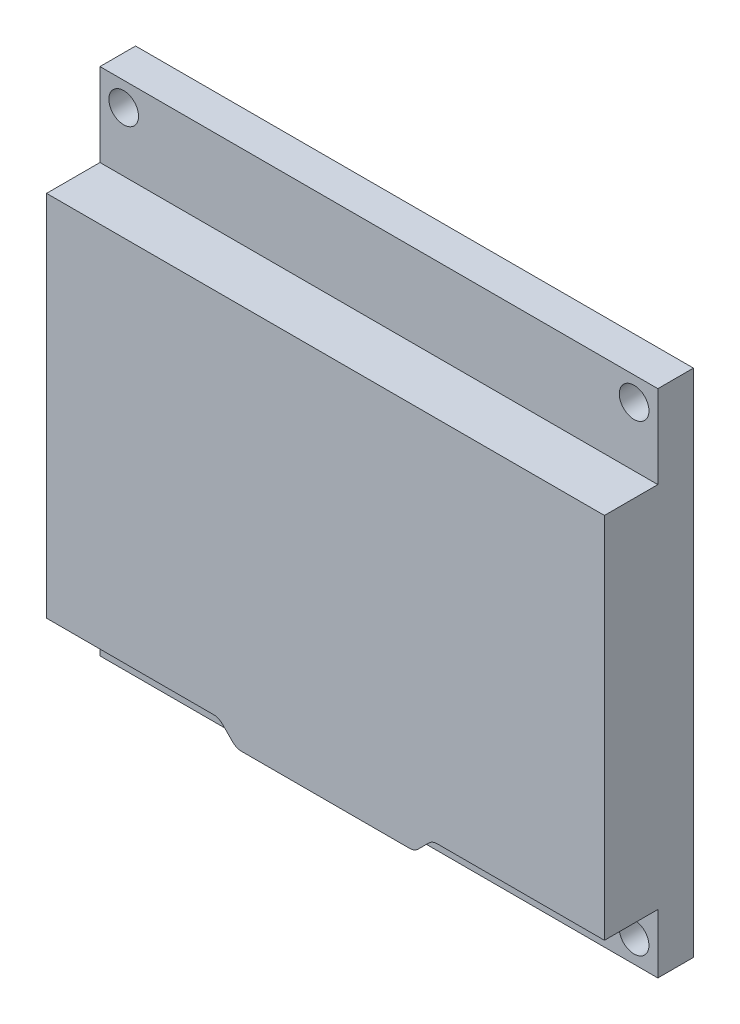
ISO-10303-21;
HEADER;
FILE_DESCRIPTION(('STEP AP214'),'2;1');
FILE_NAME('part.step','',(''),(''),'','','');
FILE_SCHEMA(('AUTOMOTIVE_DESIGN { 1 0 10303 214 1 1 1 1 }'));
ENDSEC;
DATA;
#1=APPLICATION_CONTEXT('core data for automotive mechanical design processes');
#2=APPLICATION_PROTOCOL_DEFINITION('international standard','automotive_design',2000,#1);
#3=PRODUCT_CONTEXT('',#1,'mechanical');
#4=PRODUCT('Part','Part','',(#3));
#5=PRODUCT_RELATED_PRODUCT_CATEGORY('part','',(#4));
#6=PRODUCT_DEFINITION_FORMATION('','',#4);
#7=PRODUCT_DEFINITION_CONTEXT('part definition',#1,'design');
#8=PRODUCT_DEFINITION('design','',#6,#7);
#9=PRODUCT_DEFINITION_SHAPE('','',#8);
#10=(LENGTH_UNIT() NAMED_UNIT(*) SI_UNIT(.MILLI.,.METRE.));
#11=(NAMED_UNIT(*) PLANE_ANGLE_UNIT() SI_UNIT($,.RADIAN.));
#12=(NAMED_UNIT(*) SI_UNIT($,.STERADIAN.) SOLID_ANGLE_UNIT());
#13=UNCERTAINTY_MEASURE_WITH_UNIT(LENGTH_MEASURE(1.E-05),#10,'distance_accuracy_value','');
#14=(GEOMETRIC_REPRESENTATION_CONTEXT(3) GLOBAL_UNCERTAINTY_ASSIGNED_CONTEXT((#13)) GLOBAL_UNIT_ASSIGNED_CONTEXT((#10,
#11,#12)) REPRESENTATION_CONTEXT('',''));
#15=CARTESIAN_POINT('',(0.,0.,0.));
#16=DIRECTION('',(0.,0.,1.));
#17=DIRECTION('',(1.,0.,0.));
#18=AXIS2_PLACEMENT_3D('',#15,#16,#17);
#19=CARTESIAN_POINT('',(0.,0.,3.));
#20=DIRECTION('',(0.,0.,-1.));
#21=DIRECTION('',(-1.,0.,0.));
#22=AXIS2_PLACEMENT_3D('',#19,#20,#21);
#23=PLANE('',#22);
#24=CARTESIAN_POINT('',(2.00000000000041,1.99999999999999,3.));
#25=DIRECTION('',(0.,0.,1.));
#26=DIRECTION('',(1.,0.,0.));
#27=AXIS2_PLACEMENT_3D('',#24,#25,#26);
#28=CIRCLE('',#27,1.25);
#29=CARTESIAN_POINT('',(3.25000000000041,1.99999999999999,3.));
#30=VERTEX_POINT('',#29);
#31=EDGE_CURVE('E180',#30,#30,#28,.T.);
#32=ORIENTED_EDGE('',*,*,#31,.F.);
#33=EDGE_LOOP('',(#32));
#34=FACE_BOUND('',#33,.T.);
#35=CARTESIAN_POINT('',(45.0000000000004,1.99999999999999,3.));
#36=DIRECTION('',(0.,0.,1.));
#37=DIRECTION('',(1.,0.,0.));
#38=AXIS2_PLACEMENT_3D('',#35,#36,#37);
#39=CIRCLE('',#38,1.25);
#40=CARTESIAN_POINT('',(46.2500000000004,1.99999999999999,3.));
#41=VERTEX_POINT('',#40);
#42=EDGE_CURVE('E190',#41,#41,#39,.T.);
#43=ORIENTED_EDGE('',*,*,#42,.F.);
#44=EDGE_LOOP('',(#43));
#45=FACE_BOUND('',#44,.T.);
#46=DIRECTION('',(0.707106781186544,-0.707106781186551,0.));
#47=VECTOR('',#46,1.);
#48=CARTESIAN_POINT('',(16.,3.49999999999998,3.));
#49=LINE('',#48,#47);
#50=CARTESIAN_POINT('',(15.7071067811865,3.79289321881346,3.));
#51=VERTEX_POINT('',#50);
#52=CARTESIAN_POINT('',(14.7928932188135,4.70710678118654,3.));
#53=VERTEX_POINT('',#52);
#54=EDGE_CURVE('E237',#51,#53,#49,.F.);
#55=ORIENTED_EDGE('',*,*,#54,.T.);
#56=CARTESIAN_POINT('',(14.0857864376269,4.,3.));
#57=DIRECTION('',(0.,0.,-1.));
#58=DIRECTION('',(-1.,0.,0.));
#59=AXIS2_PLACEMENT_3D('',#56,#57,#58);
#60=CIRCLE('',#59,1.);
#61=CARTESIAN_POINT('',(14.0857864376269,5.,3.));
#62=VERTEX_POINT('',#61);
#63=EDGE_CURVE('E254',#53,#62,#60,.F.);
#64=ORIENTED_EDGE('',*,*,#63,.T.);
#65=DIRECTION('',(1.,0.,0.));
#66=VECTOR('',#65,1.);
#67=CARTESIAN_POINT('',(0.,5.,3.));
#68=LINE('',#67,#66);
#69=CARTESIAN_POINT('',(0.,5.,3.));
#70=VERTEX_POINT('',#69);
#71=EDGE_CURVE('E302',#70,#62,#68,.T.);
#72=ORIENTED_EDGE('',*,*,#71,.F.);
#73=DIRECTION('',(0.,-1.,0.));
#74=VECTOR('',#73,1.);
#75=CARTESIAN_POINT('',(0.,0.,3.));
#76=LINE('',#75,#74);
#77=CARTESIAN_POINT('',(0.,0.,3.));
#78=VERTEX_POINT('',#77);
#79=EDGE_CURVE('E175',#70,#78,#76,.T.);
#80=ORIENTED_EDGE('',*,*,#79,.T.);
#81=DIRECTION('',(1.,0.,0.));
#82=VECTOR('',#81,1.);
#83=CARTESIAN_POINT('',(0.,0.,3.));
#84=LINE('',#83,#82);
#85=CARTESIAN_POINT('',(47.,0.,3.));
#86=VERTEX_POINT('',#85);
#87=EDGE_CURVE('E210',#78,#86,#84,.T.);
#88=ORIENTED_EDGE('',*,*,#87,.T.);
#89=DIRECTION('',(0.,1.,0.));
#90=VECTOR('',#89,1.);
#91=CARTESIAN_POINT('',(47.,0.,3.));
#92=LINE('',#91,#90);
#93=CARTESIAN_POINT('',(47.,5.,3.));
#94=VERTEX_POINT('',#93);
#95=EDGE_CURVE('E213',#86,#94,#92,.T.);
#96=ORIENTED_EDGE('',*,*,#95,.T.);
#97=CARTESIAN_POINT('',(32.9142135623731,5.,3.));
#98=VERTEX_POINT('',#97);
#99=EDGE_CURVE('E304',#98,#94,#68,.T.);
#100=ORIENTED_EDGE('',*,*,#99,.F.);
#101=CARTESIAN_POINT('',(32.9142135623731,4.,3.));
#102=DIRECTION('',(0.,0.,-1.));
#103=DIRECTION('',(-1.,0.,0.));
#104=AXIS2_PLACEMENT_3D('',#101,#102,#103);
#105=CIRCLE('',#104,1.);
#106=CARTESIAN_POINT('',(32.2071067811866,4.70710678118655,3.));
#107=VERTEX_POINT('',#106);
#108=EDGE_CURVE('E252',#98,#107,#105,.F.);
#109=ORIENTED_EDGE('',*,*,#108,.T.);
#110=DIRECTION('',(-0.707106781186552,-0.707106781186543,0.));
#111=VECTOR('',#110,1.);
#112=CARTESIAN_POINT('',(32.5,5.,3.));
#113=LINE('',#112,#111);
#114=CARTESIAN_POINT('',(31.2928932188135,3.79289321881345,3.));
#115=VERTEX_POINT('',#114);
#116=EDGE_CURVE('E240',#107,#115,#113,.T.);
#117=ORIENTED_EDGE('',*,*,#116,.T.);
#118=CARTESIAN_POINT('',(30.5857864376269,4.5,3.));
#119=DIRECTION('',(0.,0.,-1.));
#120=DIRECTION('',(-1.,0.,0.));
#121=AXIS2_PLACEMENT_3D('',#118,#119,#120);
#122=CIRCLE('',#121,1.);
#123=CARTESIAN_POINT('',(30.5857864376269,3.5,3.));
#124=VERTEX_POINT('',#123);
#125=EDGE_CURVE('E11',#115,#124,#122,.T.);
#126=ORIENTED_EDGE('',*,*,#125,.T.);
#127=DIRECTION('',(1.,0.,0.));
#128=VECTOR('',#127,1.);
#129=CARTESIAN_POINT('',(0.,3.5,3.));
#130=LINE('',#129,#128);
#131=CARTESIAN_POINT('',(16.4142135623731,3.5,3.));
#132=VERTEX_POINT('',#131);
#133=EDGE_CURVE('E280',#132,#124,#130,.T.);
#134=ORIENTED_EDGE('',*,*,#133,.F.);
#135=CARTESIAN_POINT('',(16.4142135623731,4.5,3.));
#136=DIRECTION('',(0.,0.,-1.));
#137=DIRECTION('',(-1.,0.,0.));
#138=AXIS2_PLACEMENT_3D('',#135,#136,#137);
#139=CIRCLE('',#138,1.);
#140=EDGE_CURVE('E274',#132,#51,#139,.T.);
#141=ORIENTED_EDGE('',*,*,#140,.T.);
#142=EDGE_LOOP('',(#55,#64,#72,#80,#88,#96,#100,#109,#117,#126,#134,#141));
#143=FACE_BOUND('',#142,.T.);
#144=ADVANCED_FACE('F35',(#34,#45,#143),#23,.F.);
#145=CARTESIAN_POINT('',(0.,43.,3.));
#146=VERTEX_POINT('',#145);
#147=CARTESIAN_POINT('',(0.,36.,3.));
#148=VERTEX_POINT('',#147);
#149=EDGE_CURVE('E208',#146,#148,#76,.T.);
#150=ORIENTED_EDGE('',*,*,#149,.T.);
#151=DIRECTION('',(1.,0.,0.));
#152=VECTOR('',#151,1.);
#153=CARTESIAN_POINT('',(0.,36.,3.));
#154=LINE('',#153,#152);
#155=CARTESIAN_POINT('',(47.,36.,3.));
#156=VERTEX_POINT('',#155);
#157=EDGE_CURVE('E169',#148,#156,#154,.T.);
#158=ORIENTED_EDGE('',*,*,#157,.T.);
#159=CARTESIAN_POINT('',(47.,43.,3.));
#160=VERTEX_POINT('',#159);
#161=EDGE_CURVE('E212',#156,#160,#92,.T.);
#162=ORIENTED_EDGE('',*,*,#161,.T.);
#163=DIRECTION('',(-1.,0.,0.));
#164=VECTOR('',#163,1.);
#165=CARTESIAN_POINT('',(0.,43.,3.));
#166=LINE('',#165,#164);
#167=EDGE_CURVE('E216',#160,#146,#166,.T.);
#168=ORIENTED_EDGE('',*,*,#167,.T.);
#169=EDGE_LOOP('',(#150,#158,#162,#168));
#170=FACE_BOUND('',#169,.T.);
#171=CARTESIAN_POINT('',(2.,41.,3.));
#172=DIRECTION('',(0.,0.,1.));
#173=DIRECTION('',(1.,0.,0.));
#174=AXIS2_PLACEMENT_3D('',#171,#172,#173);
#175=CIRCLE('',#174,1.25);
#176=CARTESIAN_POINT('',(3.25,41.,3.));
#177=VERTEX_POINT('',#176);
#178=EDGE_CURVE('E202',#177,#177,#175,.T.);
#179=ORIENTED_EDGE('',*,*,#178,.F.);
#180=EDGE_LOOP('',(#179));
#181=FACE_BOUND('',#180,.T.);
#182=CARTESIAN_POINT('',(45.,41.,3.));
#183=DIRECTION('',(0.,0.,1.));
#184=DIRECTION('',(1.,0.,0.));
#185=AXIS2_PLACEMENT_3D('',#182,#183,#184);
#186=CIRCLE('',#185,1.25);
#187=CARTESIAN_POINT('',(46.25,41.,3.));
#188=VERTEX_POINT('',#187);
#189=EDGE_CURVE('E196',#188,#188,#186,.T.);
#190=ORIENTED_EDGE('',*,*,#189,.F.);
#191=EDGE_LOOP('',(#190));
#192=FACE_BOUND('',#191,.T.);
#193=ADVANCED_FACE('F319',(#170,#181,#192),#23,.F.);
#194=CARTESIAN_POINT('',(0.,0.,0.));
#195=DIRECTION('',(0.,0.,-1.));
#196=DIRECTION('',(-1.,0.,0.));
#197=AXIS2_PLACEMENT_3D('',#194,#195,#196);
#198=PLANE('',#197);
#199=CARTESIAN_POINT('',(45.0000000000004,1.99999999999999,0.));
#200=DIRECTION('',(0.,0.,1.));
#201=DIRECTION('',(1.,0.,0.));
#202=AXIS2_PLACEMENT_3D('',#199,#200,#201);
#203=CIRCLE('',#202,1.25);
#204=CARTESIAN_POINT('',(46.2500000000004,1.99999999999999,0.));
#205=VERTEX_POINT('',#204);
#206=EDGE_CURVE('E188',#205,#205,#203,.T.);
#207=ORIENTED_EDGE('',*,*,#206,.T.);
#208=EDGE_LOOP('',(#207));
#209=FACE_BOUND('',#208,.T.);
#210=CARTESIAN_POINT('',(2.,41.,0.));
#211=DIRECTION('',(0.,0.,1.));
#212=DIRECTION('',(1.,0.,0.));
#213=AXIS2_PLACEMENT_3D('',#210,#211,#212);
#214=CIRCLE('',#213,1.25);
#215=CARTESIAN_POINT('',(3.25,41.,0.));
#216=VERTEX_POINT('',#215);
#217=EDGE_CURVE('E199',#216,#216,#214,.T.);
#218=ORIENTED_EDGE('',*,*,#217,.T.);
#219=EDGE_LOOP('',(#218));
#220=FACE_BOUND('',#219,.T.);
#221=DIRECTION('',(0.,-1.,0.));
#222=VECTOR('',#221,1.);
#223=CARTESIAN_POINT('',(0.,0.,0.));
#224=LINE('',#223,#222);
#225=CARTESIAN_POINT('',(0.,43.,0.));
#226=VERTEX_POINT('',#225);
#227=CARTESIAN_POINT('',(0.,0.,0.));
#228=VERTEX_POINT('',#227);
#229=EDGE_CURVE('E205',#226,#228,#224,.T.);
#230=ORIENTED_EDGE('',*,*,#229,.F.);
#231=DIRECTION('',(-1.,0.,0.));
#232=VECTOR('',#231,1.);
#233=CARTESIAN_POINT('',(0.,43.,0.));
#234=LINE('',#233,#232);
#235=CARTESIAN_POINT('',(47.,43.,0.));
#236=VERTEX_POINT('',#235);
#237=EDGE_CURVE('E224',#236,#226,#234,.T.);
#238=ORIENTED_EDGE('',*,*,#237,.F.);
#239=DIRECTION('',(0.,1.,0.));
#240=VECTOR('',#239,1.);
#241=CARTESIAN_POINT('',(47.,0.,0.));
#242=LINE('',#241,#240);
#243=CARTESIAN_POINT('',(47.,0.,0.));
#244=VERTEX_POINT('',#243);
#245=EDGE_CURVE('E222',#244,#236,#242,.T.);
#246=ORIENTED_EDGE('',*,*,#245,.F.);
#247=DIRECTION('',(1.,0.,0.));
#248=VECTOR('',#247,1.);
#249=CARTESIAN_POINT('',(0.,0.,0.));
#250=LINE('',#249,#248);
#251=EDGE_CURVE('E220',#228,#244,#250,.T.);
#252=ORIENTED_EDGE('',*,*,#251,.F.);
#253=EDGE_LOOP('',(#230,#238,#246,#252));
#254=FACE_BOUND('',#253,.T.);
#255=CARTESIAN_POINT('',(45.,41.,0.));
#256=DIRECTION('',(0.,0.,1.));
#257=DIRECTION('',(1.,0.,0.));
#258=AXIS2_PLACEMENT_3D('',#255,#256,#257);
#259=CIRCLE('',#258,1.25);
#260=CARTESIAN_POINT('',(46.25,41.,0.));
#261=VERTEX_POINT('',#260);
#262=EDGE_CURVE('E193',#261,#261,#259,.T.);
#263=ORIENTED_EDGE('',*,*,#262,.T.);
#264=EDGE_LOOP('',(#263));
#265=FACE_BOUND('',#264,.T.);
#266=CARTESIAN_POINT('',(2.00000000000041,1.99999999999999,0.));
#267=DIRECTION('',(0.,0.,1.));
#268=DIRECTION('',(1.,0.,0.));
#269=AXIS2_PLACEMENT_3D('',#266,#267,#268);
#270=CIRCLE('',#269,1.25);
#271=CARTESIAN_POINT('',(3.25000000000041,1.99999999999999,0.));
#272=VERTEX_POINT('',#271);
#273=EDGE_CURVE('E176',#272,#272,#270,.T.);
#274=ORIENTED_EDGE('',*,*,#273,.T.);
#275=EDGE_LOOP('',(#274));
#276=FACE_BOUND('',#275,.T.);
#277=ADVANCED_FACE('F327',(#209,#220,#254,#265,#276),#198,.T.);
#278=CARTESIAN_POINT('',(0.,0.,3.));
#279=DIRECTION('',(1.,0.,0.));
#280=DIRECTION('',(0.,0.,-1.));
#281=AXIS2_PLACEMENT_3D('',#278,#279,#280);
#282=PLANE('',#281);
#283=ORIENTED_EDGE('',*,*,#229,.T.);
#284=DIRECTION('',(0.,0.,-1.));
#285=VECTOR('',#284,1.);
#286=CARTESIAN_POINT('',(0.,0.,3.));
#287=LINE('',#286,#285);
#288=EDGE_CURVE('E234',#78,#228,#287,.T.);
#289=ORIENTED_EDGE('',*,*,#288,.F.);
#290=ORIENTED_EDGE('',*,*,#79,.F.);
#291=DIRECTION('',(0.,0.,-1.));
#292=VECTOR('',#291,1.);
#293=CARTESIAN_POINT('',(0.,5.,7.5));
#294=LINE('',#293,#292);
#295=CARTESIAN_POINT('',(0.,5.,7.5));
#296=VERTEX_POINT('',#295);
#297=EDGE_CURVE('E154',#296,#70,#294,.T.);
#298=ORIENTED_EDGE('',*,*,#297,.F.);
#299=DIRECTION('',(0.,-1.,0.));
#300=VECTOR('',#299,1.);
#301=CARTESIAN_POINT('',(0.,0.,7.5));
#302=LINE('',#301,#300);
#303=CARTESIAN_POINT('',(0.,36.,7.5));
#304=VERTEX_POINT('',#303);
#305=EDGE_CURVE('E158',#304,#296,#302,.T.);
#306=ORIENTED_EDGE('',*,*,#305,.F.);
#307=DIRECTION('',(0.,0.,-1.));
#308=VECTOR('',#307,1.);
#309=CARTESIAN_POINT('',(0.,36.,7.5));
#310=LINE('',#309,#308);
#311=EDGE_CURVE('E301',#304,#148,#310,.T.);
#312=ORIENTED_EDGE('',*,*,#311,.T.);
#313=ORIENTED_EDGE('',*,*,#149,.F.);
#314=DIRECTION('',(0.,0.,-1.));
#315=VECTOR('',#314,1.);
#316=CARTESIAN_POINT('',(0.,43.,3.));
#317=LINE('',#316,#315);
#318=EDGE_CURVE('E218',#146,#226,#317,.T.);
#319=ORIENTED_EDGE('',*,*,#318,.T.);
#320=EDGE_LOOP('',(#283,#289,#290,#298,#306,#312,#313,#319));
#321=FACE_BOUND('',#320,.T.);
#322=ADVANCED_FACE('F173',(#321),#282,.F.);
#323=CARTESIAN_POINT('',(0.,0.,3.));
#324=DIRECTION('',(0.,1.,0.));
#325=DIRECTION('',(0.,0.,1.));
#326=AXIS2_PLACEMENT_3D('',#323,#324,#325);
#327=PLANE('',#326);
#328=ORIENTED_EDGE('',*,*,#251,.T.);
#329=DIRECTION('',(0.,0.,-1.));
#330=VECTOR('',#329,1.);
#331=CARTESIAN_POINT('',(47.,0.,3.));
#332=LINE('',#331,#330);
#333=EDGE_CURVE('E231',#86,#244,#332,.T.);
#334=ORIENTED_EDGE('',*,*,#333,.F.);
#335=ORIENTED_EDGE('',*,*,#87,.F.);
#336=ORIENTED_EDGE('',*,*,#288,.T.);
#337=EDGE_LOOP('',(#328,#334,#335,#336));
#338=FACE_BOUND('',#337,.T.);
#339=ADVANCED_FACE('F333',(#338),#327,.F.);
#340=CARTESIAN_POINT('',(47.,0.,3.));
#341=DIRECTION('',(-1.,0.,0.));
#342=DIRECTION('',(0.,0.,1.));
#343=AXIS2_PLACEMENT_3D('',#340,#341,#342);
#344=PLANE('',#343);
#345=ORIENTED_EDGE('',*,*,#245,.T.);
#346=DIRECTION('',(0.,0.,-1.));
#347=VECTOR('',#346,1.);
#348=CARTESIAN_POINT('',(47.,43.,3.));
#349=LINE('',#348,#347);
#350=EDGE_CURVE('E228',#160,#236,#349,.T.);
#351=ORIENTED_EDGE('',*,*,#350,.F.);
#352=ORIENTED_EDGE('',*,*,#161,.F.);
#353=DIRECTION('',(0.,0.,-1.));
#354=VECTOR('',#353,1.);
#355=CARTESIAN_POINT('',(47.,36.,7.5));
#356=LINE('',#355,#354);
#357=CARTESIAN_POINT('',(47.,36.,7.5));
#358=VERTEX_POINT('',#357);
#359=EDGE_CURVE('E183',#358,#156,#356,.T.);
#360=ORIENTED_EDGE('',*,*,#359,.F.);
#361=DIRECTION('',(0.,1.,0.));
#362=VECTOR('',#361,1.);
#363=CARTESIAN_POINT('',(47.,0.,7.5));
#364=LINE('',#363,#362);
#365=CARTESIAN_POINT('',(47.,5.,7.5));
#366=VERTEX_POINT('',#365);
#367=EDGE_CURVE('E297',#366,#358,#364,.T.);
#368=ORIENTED_EDGE('',*,*,#367,.F.);
#369=DIRECTION('',(0.,0.,-1.));
#370=VECTOR('',#369,1.);
#371=CARTESIAN_POINT('',(47.,5.,7.5));
#372=LINE('',#371,#370);
#373=EDGE_CURVE('E177',#366,#94,#372,.T.);
#374=ORIENTED_EDGE('',*,*,#373,.T.);
#375=ORIENTED_EDGE('',*,*,#95,.F.);
#376=ORIENTED_EDGE('',*,*,#333,.T.);
#377=EDGE_LOOP('',(#345,#351,#352,#360,#368,#374,#375,#376));
#378=FACE_BOUND('',#377,.T.);
#379=ADVANCED_FACE('F315',(#378),#344,.F.);
#380=CARTESIAN_POINT('',(0.,43.,3.));
#381=DIRECTION('',(0.,-1.,0.));
#382=DIRECTION('',(0.,0.,-1.));
#383=AXIS2_PLACEMENT_3D('',#380,#381,#382);
#384=PLANE('',#383);
#385=ORIENTED_EDGE('',*,*,#237,.T.);
#386=ORIENTED_EDGE('',*,*,#318,.F.);
#387=ORIENTED_EDGE('',*,*,#167,.F.);
#388=ORIENTED_EDGE('',*,*,#350,.T.);
#389=EDGE_LOOP('',(#385,#386,#387,#388));
#390=FACE_BOUND('',#389,.T.);
#391=ADVANCED_FACE('F363',(#390),#384,.F.);
#392=CARTESIAN_POINT('',(2.,41.,3.));
#393=DIRECTION('',(0.,0.,-1.));
#394=DIRECTION('',(-1.,0.,0.));
#395=AXIS2_PLACEMENT_3D('',#392,#393,#394);
#396=CYLINDRICAL_SURFACE('',#395,1.25);
#397=ORIENTED_EDGE('',*,*,#178,.T.);
#398=EDGE_LOOP('',(#397));
#399=FACE_BOUND('',#398,.T.);
#400=ORIENTED_EDGE('',*,*,#217,.F.);
#401=EDGE_LOOP('',(#400));
#402=FACE_BOUND('',#401,.T.);
#403=ADVANCED_FACE('F358',(#399,#402),#396,.F.);
#404=CARTESIAN_POINT('',(45.,41.,3.));
#405=DIRECTION('',(0.,0.,-1.));
#406=DIRECTION('',(-1.,0.,0.));
#407=AXIS2_PLACEMENT_3D('',#404,#405,#406);
#408=CYLINDRICAL_SURFACE('',#407,1.25);
#409=ORIENTED_EDGE('',*,*,#189,.T.);
#410=EDGE_LOOP('',(#409));
#411=FACE_BOUND('',#410,.T.);
#412=ORIENTED_EDGE('',*,*,#262,.F.);
#413=EDGE_LOOP('',(#412));
#414=FACE_BOUND('',#413,.T.);
#415=ADVANCED_FACE('F402',(#411,#414),#408,.F.);
#416=CARTESIAN_POINT('',(45.0000000000004,1.99999999999999,3.));
#417=DIRECTION('',(0.,0.,-1.));
#418=DIRECTION('',(-1.,0.,0.));
#419=AXIS2_PLACEMENT_3D('',#416,#417,#418);
#420=CYLINDRICAL_SURFACE('',#419,1.25);
#421=ORIENTED_EDGE('',*,*,#42,.T.);
#422=EDGE_LOOP('',(#421));
#423=FACE_BOUND('',#422,.T.);
#424=ORIENTED_EDGE('',*,*,#206,.F.);
#425=EDGE_LOOP('',(#424));
#426=FACE_BOUND('',#425,.T.);
#427=ADVANCED_FACE('F396',(#423,#426),#420,.F.);
#428=CARTESIAN_POINT('',(2.00000000000041,1.99999999999999,3.));
#429=DIRECTION('',(0.,0.,-1.));
#430=DIRECTION('',(-1.,0.,0.));
#431=AXIS2_PLACEMENT_3D('',#428,#429,#430);
#432=CYLINDRICAL_SURFACE('',#431,1.25);
#433=ORIENTED_EDGE('',*,*,#31,.T.);
#434=EDGE_LOOP('',(#433));
#435=FACE_BOUND('',#434,.T.);
#436=ORIENTED_EDGE('',*,*,#273,.F.);
#437=EDGE_LOOP('',(#436));
#438=FACE_BOUND('',#437,.T.);
#439=ADVANCED_FACE('F392',(#435,#438),#432,.F.);
#440=CARTESIAN_POINT('',(0.,5.,7.5));
#441=DIRECTION('',(0.,1.,0.));
#442=DIRECTION('',(0.,0.,1.));
#443=AXIS2_PLACEMENT_3D('',#440,#441,#442);
#444=PLANE('',#443);
#445=ORIENTED_EDGE('',*,*,#71,.T.);
#446=DIRECTION('',(0.,0.,-1.));
#447=VECTOR('',#446,1.);
#448=CARTESIAN_POINT('',(14.0857864376269,5.,7.5));
#449=LINE('',#448,#447);
#450=CARTESIAN_POINT('',(14.0857864376269,5.,7.5));
#451=VERTEX_POINT('',#450);
#452=EDGE_CURVE('E156',#62,#451,#449,.F.);
#453=ORIENTED_EDGE('',*,*,#452,.T.);
#454=DIRECTION('',(1.,0.,0.));
#455=VECTOR('',#454,1.);
#456=CARTESIAN_POINT('',(0.,5.,7.5));
#457=LINE('',#456,#455);
#458=EDGE_CURVE('E149',#296,#451,#457,.T.);
#459=ORIENTED_EDGE('',*,*,#458,.F.);
#460=ORIENTED_EDGE('',*,*,#297,.T.);
#461=EDGE_LOOP('',(#445,#453,#459,#460));
#462=FACE_BOUND('',#461,.T.);
#463=ADVANCED_FACE('F152',(#462),#444,.F.);
#464=CARTESIAN_POINT('',(0.,3.5,7.5));
#465=DIRECTION('',(0.,1.,0.));
#466=DIRECTION('',(0.,0.,1.));
#467=AXIS2_PLACEMENT_3D('',#464,#465,#466);
#468=PLANE('',#467);
#469=DIRECTION('',(1.,0.,0.));
#470=VECTOR('',#469,1.);
#471=CARTESIAN_POINT('',(0.,3.5,7.5));
#472=LINE('',#471,#470);
#473=CARTESIAN_POINT('',(16.4142135623731,3.5,7.5));
#474=VERTEX_POINT('',#473);
#475=CARTESIAN_POINT('',(30.5857864376269,3.5,7.5));
#476=VERTEX_POINT('',#475);
#477=EDGE_CURVE('E157',#474,#476,#472,.T.);
#478=ORIENTED_EDGE('',*,*,#477,.F.);
#479=DIRECTION('',(0.,0.,1.));
#480=VECTOR('',#479,1.);
#481=CARTESIAN_POINT('',(16.4142135623731,3.5,7.5));
#482=LINE('',#481,#480);
#483=EDGE_CURVE('E258',#474,#132,#482,.F.);
#484=ORIENTED_EDGE('',*,*,#483,.T.);
#485=ORIENTED_EDGE('',*,*,#133,.T.);
#486=DIRECTION('',(0.,0.,-1.));
#487=VECTOR('',#486,1.);
#488=CARTESIAN_POINT('',(30.5857864376269,3.5,7.5));
#489=LINE('',#488,#487);
#490=EDGE_CURVE('E256',#124,#476,#489,.F.);
#491=ORIENTED_EDGE('',*,*,#490,.T.);
#492=EDGE_LOOP('',(#478,#484,#485,#491));
#493=FACE_BOUND('',#492,.T.);
#494=ADVANCED_FACE('F294',(#493),#468,.F.);
#495=CARTESIAN_POINT('',(32.9142135623731,5.,7.5));
#496=VERTEX_POINT('',#495);
#497=EDGE_CURVE('E160',#496,#366,#457,.T.);
#498=ORIENTED_EDGE('',*,*,#497,.F.);
#499=DIRECTION('',(0.,0.,-1.));
#500=VECTOR('',#499,1.);
#501=CARTESIAN_POINT('',(32.9142135623731,5.,3.));
#502=LINE('',#501,#500);
#503=EDGE_CURVE('E265',#496,#98,#502,.T.);
#504=ORIENTED_EDGE('',*,*,#503,.T.);
#505=ORIENTED_EDGE('',*,*,#99,.T.);
#506=ORIENTED_EDGE('',*,*,#373,.F.);
#507=EDGE_LOOP('',(#498,#504,#505,#506));
#508=FACE_BOUND('',#507,.T.);
#509=ADVANCED_FACE('F381',(#508),#444,.F.);
#510=CARTESIAN_POINT('',(0.,36.,7.5));
#511=DIRECTION('',(0.,1.,0.));
#512=DIRECTION('',(0.,0.,1.));
#513=AXIS2_PLACEMENT_3D('',#510,#511,#512);
#514=PLANE('',#513);
#515=ORIENTED_EDGE('',*,*,#157,.F.);
#516=ORIENTED_EDGE('',*,*,#311,.F.);
#517=DIRECTION('',(1.,0.,0.));
#518=VECTOR('',#517,1.);
#519=CARTESIAN_POINT('',(0.,36.,7.5));
#520=LINE('',#519,#518);
#521=EDGE_CURVE('E166',#304,#358,#520,.T.);
#522=ORIENTED_EDGE('',*,*,#521,.T.);
#523=ORIENTED_EDGE('',*,*,#359,.T.);
#524=EDGE_LOOP('',(#515,#516,#522,#523));
#525=FACE_BOUND('',#524,.T.);
#526=ADVANCED_FACE('F311',(#525),#514,.T.);
#527=CARTESIAN_POINT('',(0.,0.,7.5));
#528=DIRECTION('',(0.,0.,1.));
#529=DIRECTION('',(1.,0.,0.));
#530=AXIS2_PLACEMENT_3D('',#527,#528,#529);
#531=PLANE('',#530);
#532=DIRECTION('',(-0.707106781186544,0.707106781186551,0.));
#533=VECTOR('',#532,1.);
#534=CARTESIAN_POINT('',(16.,3.49999999999998,7.5));
#535=LINE('',#534,#533);
#536=CARTESIAN_POINT('',(14.7928932188135,4.70710678118654,7.5));
#537=VERTEX_POINT('',#536);
#538=CARTESIAN_POINT('',(15.7071067811865,3.79289321881346,7.5));
#539=VERTEX_POINT('',#538);
#540=EDGE_CURVE('E245',#537,#539,#535,.F.);
#541=ORIENTED_EDGE('',*,*,#540,.T.);
#542=CARTESIAN_POINT('',(16.4142135623731,4.5,7.5));
#543=DIRECTION('',(0.,0.,1.));
#544=DIRECTION('',(1.,0.,0.));
#545=AXIS2_PLACEMENT_3D('',#542,#543,#544);
#546=CIRCLE('',#545,1.);
#547=EDGE_CURVE('E263',#539,#474,#546,.T.);
#548=ORIENTED_EDGE('',*,*,#547,.T.);
#549=ORIENTED_EDGE('',*,*,#477,.T.);
#550=CARTESIAN_POINT('',(30.5857864376269,4.5,7.5));
#551=DIRECTION('',(0.,0.,1.));
#552=DIRECTION('',(1.,0.,0.));
#553=AXIS2_PLACEMENT_3D('',#550,#551,#552);
#554=CIRCLE('',#553,1.);
#555=CARTESIAN_POINT('',(31.2928932188135,3.79289321881345,7.5));
#556=VERTEX_POINT('',#555);
#557=EDGE_CURVE('E261',#476,#556,#554,.T.);
#558=ORIENTED_EDGE('',*,*,#557,.T.);
#559=DIRECTION('',(0.707106781186552,0.707106781186543,0.));
#560=VECTOR('',#559,1.);
#561=CARTESIAN_POINT('',(32.5,5.,7.5));
#562=LINE('',#561,#560);
#563=CARTESIAN_POINT('',(32.2071067811866,4.70710678118655,7.5));
#564=VERTEX_POINT('',#563);
#565=EDGE_CURVE('E243',#556,#564,#562,.T.);
#566=ORIENTED_EDGE('',*,*,#565,.T.);
#567=CARTESIAN_POINT('',(32.9142135623731,4.,7.5));
#568=DIRECTION('',(0.,0.,1.));
#569=DIRECTION('',(1.,0.,0.));
#570=AXIS2_PLACEMENT_3D('',#567,#568,#569);
#571=CIRCLE('',#570,1.);
#572=EDGE_CURVE('E43',#564,#496,#571,.F.);
#573=ORIENTED_EDGE('',*,*,#572,.T.);
#574=ORIENTED_EDGE('',*,*,#497,.T.);
#575=ORIENTED_EDGE('',*,*,#367,.T.);
#576=ORIENTED_EDGE('',*,*,#521,.F.);
#577=ORIENTED_EDGE('',*,*,#305,.T.);
#578=ORIENTED_EDGE('',*,*,#458,.T.);
#579=CARTESIAN_POINT('',(14.0857864376269,4.,7.5));
#580=DIRECTION('',(0.,0.,1.));
#581=DIRECTION('',(1.,0.,0.));
#582=AXIS2_PLACEMENT_3D('',#579,#580,#581);
#583=CIRCLE('',#582,1.);
#584=EDGE_CURVE('E272',#451,#537,#583,.F.);
#585=ORIENTED_EDGE('',*,*,#584,.T.);
#586=EDGE_LOOP('',(#541,#548,#549,#558,#566,#573,#574,#575,#576,#577,#578,#585));
#587=FACE_BOUND('',#586,.T.);
#588=ADVANCED_FACE('F164',(#587),#531,.T.);
#589=CARTESIAN_POINT('',(32.5,5.,7.5));
#590=DIRECTION('',(-0.707106781186543,0.707106781186552,0.));
#591=DIRECTION('',(0.,0.,-1.));
#592=AXIS2_PLACEMENT_3D('',#589,#590,#591);
#593=PLANE('',#592);
#594=ORIENTED_EDGE('',*,*,#116,.F.);
#595=DIRECTION('',(0.,0.,-1.));
#596=VECTOR('',#595,1.);
#597=CARTESIAN_POINT('',(32.2071067811866,4.70710678118655,7.5));
#598=LINE('',#597,#596);
#599=EDGE_CURVE('E57',#107,#564,#598,.F.);
#600=ORIENTED_EDGE('',*,*,#599,.T.);
#601=ORIENTED_EDGE('',*,*,#565,.F.);
#602=DIRECTION('',(0.,0.,-1.));
#603=VECTOR('',#602,1.);
#604=CARTESIAN_POINT('',(31.2928932188135,3.79289321881345,7.5));
#605=LINE('',#604,#603);
#606=EDGE_CURVE('E268',#556,#115,#605,.T.);
#607=ORIENTED_EDGE('',*,*,#606,.T.);
#608=EDGE_LOOP('',(#594,#600,#601,#607));
#609=FACE_BOUND('',#608,.T.);
#610=ADVANCED_FACE('F346',(#609),#593,.F.);
#611=CARTESIAN_POINT('',(16.,3.49999999999998,7.5));
#612=DIRECTION('',(-0.707106781186551,-0.707106781186544,0.));
#613=DIRECTION('',(0.,0.,1.));
#614=AXIS2_PLACEMENT_3D('',#611,#612,#613);
#615=PLANE('',#614);
#616=ORIENTED_EDGE('',*,*,#540,.F.);
#617=DIRECTION('',(0.,0.,1.));
#618=VECTOR('',#617,1.);
#619=CARTESIAN_POINT('',(14.7928932188135,4.70710678118654,3.));
#620=LINE('',#619,#618);
#621=EDGE_CURVE('E250',#537,#53,#620,.F.);
#622=ORIENTED_EDGE('',*,*,#621,.T.);
#623=ORIENTED_EDGE('',*,*,#54,.F.);
#624=DIRECTION('',(0.,0.,-1.));
#625=VECTOR('',#624,1.);
#626=CARTESIAN_POINT('',(15.7071067811865,3.79289321881346,7.5));
#627=LINE('',#626,#625);
#628=EDGE_CURVE('E248',#51,#539,#627,.F.);
#629=ORIENTED_EDGE('',*,*,#628,.T.);
#630=EDGE_LOOP('',(#616,#622,#623,#629));
#631=FACE_BOUND('',#630,.T.);
#632=ADVANCED_FACE('F286',(#631),#615,.T.);
#633=CARTESIAN_POINT('',(14.0857864376269,4.,7.5));
#634=DIRECTION('',(0.,0.,1.));
#635=DIRECTION('',(1.,0.,0.));
#636=AXIS2_PLACEMENT_3D('',#633,#634,#635);
#637=CYLINDRICAL_SURFACE('',#636,1.);
#638=ORIENTED_EDGE('',*,*,#63,.F.);
#639=ORIENTED_EDGE('',*,*,#621,.F.);
#640=ORIENTED_EDGE('',*,*,#584,.F.);
#641=ORIENTED_EDGE('',*,*,#452,.F.);
#642=EDGE_LOOP('',(#638,#639,#640,#641));
#643=FACE_BOUND('',#642,.T.);
#644=ADVANCED_FACE('F337',(#643),#637,.F.);
#645=CARTESIAN_POINT('',(16.4142135623731,4.5,7.5));
#646=DIRECTION('',(0.,0.,1.));
#647=DIRECTION('',(1.,0.,0.));
#648=AXIS2_PLACEMENT_3D('',#645,#646,#647);
#649=CYLINDRICAL_SURFACE('',#648,1.);
#650=ORIENTED_EDGE('',*,*,#547,.F.);
#651=ORIENTED_EDGE('',*,*,#628,.F.);
#652=ORIENTED_EDGE('',*,*,#140,.F.);
#653=ORIENTED_EDGE('',*,*,#483,.F.);
#654=EDGE_LOOP('',(#650,#651,#652,#653));
#655=FACE_BOUND('',#654,.T.);
#656=ADVANCED_FACE('F289',(#655),#649,.T.);
#657=CARTESIAN_POINT('',(32.9142135623731,4.,7.5));
#658=DIRECTION('',(0.,0.,1.));
#659=DIRECTION('',(1.,0.,0.));
#660=AXIS2_PLACEMENT_3D('',#657,#658,#659);
#661=CYLINDRICAL_SURFACE('',#660,1.);
#662=ORIENTED_EDGE('',*,*,#572,.F.);
#663=ORIENTED_EDGE('',*,*,#599,.F.);
#664=ORIENTED_EDGE('',*,*,#108,.F.);
#665=ORIENTED_EDGE('',*,*,#503,.F.);
#666=EDGE_LOOP('',(#662,#663,#664,#665));
#667=FACE_BOUND('',#666,.T.);
#668=ADVANCED_FACE('F344',(#667),#661,.F.);
#669=CARTESIAN_POINT('',(30.5857864376269,4.5,7.5));
#670=DIRECTION('',(0.,0.,-1.));
#671=DIRECTION('',(-1.,0.,0.));
#672=AXIS2_PLACEMENT_3D('',#669,#670,#671);
#673=CYLINDRICAL_SURFACE('',#672,1.);
#674=ORIENTED_EDGE('',*,*,#557,.F.);
#675=ORIENTED_EDGE('',*,*,#490,.F.);
#676=ORIENTED_EDGE('',*,*,#125,.F.);
#677=ORIENTED_EDGE('',*,*,#606,.F.);
#678=EDGE_LOOP('',(#674,#675,#676,#677));
#679=FACE_BOUND('',#678,.T.);
#680=ADVANCED_FACE('F37',(#679),#673,.T.);
#681=CLOSED_SHELL('',(#144,#193,#277,#322,#339,#379,#391,#403,#415,#427,#439,#463,#494,#509,
#526,#588,#610,#632,#644,#656,#668,#680));
#682=MANIFOLD_SOLID_BREP('B2',#681);
#683=ADVANCED_BREP_SHAPE_REPRESENTATION('',(#18,#682),#14);
#684=SHAPE_DEFINITION_REPRESENTATION(#9,#683);
ENDSEC;
END-ISO-10303-21;
